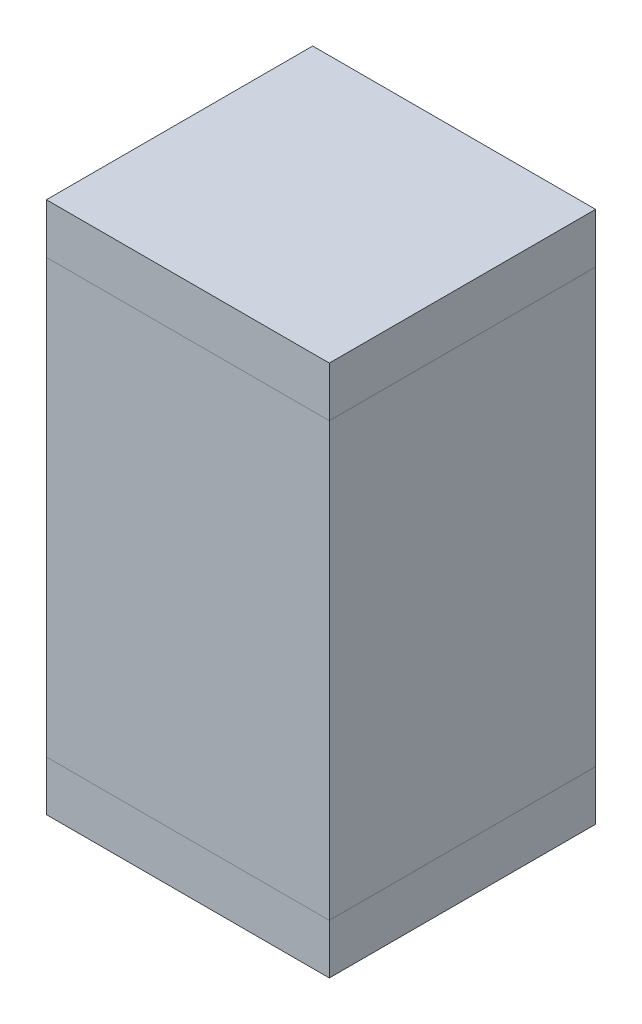
ISO-10303-21;
HEADER;
FILE_DESCRIPTION(('STEP AP214'),'2;1');
FILE_NAME('part.step','',(''),(''),'','','');
FILE_SCHEMA(('AUTOMOTIVE_DESIGN { 1 0 10303 214 1 1 1 1 }'));
ENDSEC;
DATA;
#1=APPLICATION_CONTEXT('core data for automotive mechanical design processes');
#2=APPLICATION_PROTOCOL_DEFINITION('international standard','automotive_design',2000,#1);
#3=PRODUCT_CONTEXT('',#1,'mechanical');
#4=PRODUCT('Part','Part','',(#3));
#5=PRODUCT_RELATED_PRODUCT_CATEGORY('part','',(#4));
#6=PRODUCT_DEFINITION_FORMATION('','',#4);
#7=PRODUCT_DEFINITION_CONTEXT('part definition',#1,'design');
#8=PRODUCT_DEFINITION('design','',#6,#7);
#9=PRODUCT_DEFINITION_SHAPE('','',#8);
#10=(LENGTH_UNIT() NAMED_UNIT(*) SI_UNIT(.MILLI.,.METRE.));
#11=(NAMED_UNIT(*) PLANE_ANGLE_UNIT() SI_UNIT($,.RADIAN.));
#12=(NAMED_UNIT(*) SI_UNIT($,.STERADIAN.) SOLID_ANGLE_UNIT());
#13=UNCERTAINTY_MEASURE_WITH_UNIT(LENGTH_MEASURE(1.E-05),#10,'distance_accuracy_value','');
#14=(GEOMETRIC_REPRESENTATION_CONTEXT(3) GLOBAL_UNCERTAINTY_ASSIGNED_CONTEXT((#13)) GLOBAL_UNIT_ASSIGNED_CONTEXT((#10,
#11,#12)) REPRESENTATION_CONTEXT('',''));
#15=CARTESIAN_POINT('',(0.,0.,0.));
#16=DIRECTION('',(0.,0.,1.));
#17=DIRECTION('',(1.,0.,0.));
#18=AXIS2_PLACEMENT_3D('',#15,#16,#17);
#19=CARTESIAN_POINT('',(0.,0.,0.));
#20=DIRECTION('',(0.,0.,1.));
#21=DIRECTION('',(1.,0.,0.));
#22=AXIS2_PLACEMENT_3D('',#19,#20,#21);
#23=PLANE('',#22);
#24=DIRECTION('',(1.,0.,0.));
#25=VECTOR('',#24,1.);
#26=CARTESIAN_POINT('',(-0.425,0.65,0.));
#27=LINE('',#26,#25);
#28=CARTESIAN_POINT('',(-0.425,0.65,0.));
#29=VERTEX_POINT('',#28);
#30=CARTESIAN_POINT('',(0.425,0.65,0.));
#31=VERTEX_POINT('',#30);
#32=EDGE_CURVE('P0_E27',#29,#31,#27,.T.);
#33=ORIENTED_EDGE('',*,*,#32,.T.);
#34=DIRECTION('',(0.,-1.,0.));
#35=VECTOR('',#34,1.);
#36=CARTESIAN_POINT('',(0.425,0.65,0.));
#37=LINE('',#36,#35);
#38=CARTESIAN_POINT('',(0.425,-0.65,0.));
#39=VERTEX_POINT('',#38);
#40=EDGE_CURVE('P0_E107',#31,#39,#37,.T.);
#41=ORIENTED_EDGE('',*,*,#40,.T.);
#42=DIRECTION('',(-1.,0.,0.));
#43=VECTOR('',#42,1.);
#44=CARTESIAN_POINT('',(0.425,-0.65,0.));
#45=LINE('',#44,#43);
#46=CARTESIAN_POINT('',(-0.425,-0.65,0.));
#47=VERTEX_POINT('',#46);
#48=EDGE_CURVE('P0_E80',#39,#47,#45,.T.);
#49=ORIENTED_EDGE('',*,*,#48,.T.);
#50=DIRECTION('',(0.,1.,0.));
#51=VECTOR('',#50,1.);
#52=CARTESIAN_POINT('',(-0.425,-0.65,0.));
#53=LINE('',#52,#51);
#54=EDGE_CURVE('P0_E57',#47,#29,#53,.T.);
#55=ORIENTED_EDGE('',*,*,#54,.T.);
#56=EDGE_LOOP('',(#33,#41,#49,#55));
#57=FACE_BOUND('',#56,.T.);
#58=ADVANCED_FACE('P0_F17',(#57),#23,.F.);
#59=CARTESIAN_POINT('',(0.,0.,0.8));
#60=DIRECTION('',(0.,0.,1.));
#61=DIRECTION('',(1.,0.,0.));
#62=AXIS2_PLACEMENT_3D('',#59,#60,#61);
#63=PLANE('',#62);
#64=DIRECTION('',(-1.,0.,0.));
#65=VECTOR('',#64,1.);
#66=CARTESIAN_POINT('',(-0.425,0.65,0.8));
#67=LINE('',#66,#65);
#68=CARTESIAN_POINT('',(0.425,0.65,0.8));
#69=VERTEX_POINT('',#68);
#70=CARTESIAN_POINT('',(-0.425,0.65,0.8));
#71=VERTEX_POINT('',#70);
#72=EDGE_CURVE('P0_E11',#69,#71,#67,.T.);
#73=ORIENTED_EDGE('',*,*,#72,.T.);
#74=DIRECTION('',(0.,-1.,0.));
#75=VECTOR('',#74,1.);
#76=CARTESIAN_POINT('',(-0.425,-0.65,0.8));
#77=LINE('',#76,#75);
#78=CARTESIAN_POINT('',(-0.425,-0.65,0.8));
#79=VERTEX_POINT('',#78);
#80=EDGE_CURVE('P0_E62',#71,#79,#77,.T.);
#81=ORIENTED_EDGE('',*,*,#80,.T.);
#82=DIRECTION('',(1.,0.,0.));
#83=VECTOR('',#82,1.);
#84=CARTESIAN_POINT('',(0.425,-0.65,0.8));
#85=LINE('',#84,#83);
#86=CARTESIAN_POINT('',(0.425,-0.65,0.8));
#87=VERTEX_POINT('',#86);
#88=EDGE_CURVE('P0_E64',#79,#87,#85,.T.);
#89=ORIENTED_EDGE('',*,*,#88,.T.);
#90=DIRECTION('',(0.,1.,0.));
#91=VECTOR('',#90,1.);
#92=CARTESIAN_POINT('',(0.425,0.65,0.8));
#93=LINE('',#92,#91);
#94=EDGE_CURVE('P0_E100',#87,#69,#93,.T.);
#95=ORIENTED_EDGE('',*,*,#94,.T.);
#96=EDGE_LOOP('',(#73,#81,#89,#95));
#97=FACE_BOUND('',#96,.T.);
#98=ADVANCED_FACE('P0_F19',(#97),#63,.T.);
#99=CARTESIAN_POINT('',(0.425,0.65,0.));
#100=DIRECTION('',(0.,1.,0.));
#101=DIRECTION('',(1.,0.,0.));
#102=AXIS2_PLACEMENT_3D('',#99,#100,#101);
#103=PLANE('',#102);
#104=ORIENTED_EDGE('',*,*,#32,.F.);
#105=DIRECTION('',(0.,0.,1.));
#106=VECTOR('',#105,1.);
#107=CARTESIAN_POINT('',(-0.425,0.65,0.));
#108=LINE('',#107,#106);
#109=EDGE_CURVE('P0_E67',#29,#71,#108,.T.);
#110=ORIENTED_EDGE('',*,*,#109,.T.);
#111=ORIENTED_EDGE('',*,*,#72,.F.);
#112=DIRECTION('',(0.,0.,1.));
#113=VECTOR('',#112,1.);
#114=CARTESIAN_POINT('',(0.425,0.65,0.));
#115=LINE('',#114,#113);
#116=EDGE_CURVE('P0_E103',#31,#69,#115,.T.);
#117=ORIENTED_EDGE('',*,*,#116,.F.);
#118=EDGE_LOOP('',(#104,#110,#111,#117));
#119=FACE_BOUND('',#118,.T.);
#120=ADVANCED_FACE('P0_F130',(#119),#103,.T.);
#121=CARTESIAN_POINT('',(-0.425,0.65,0.));
#122=DIRECTION('',(-1.,0.,0.));
#123=DIRECTION('',(0.,0.,1.));
#124=AXIS2_PLACEMENT_3D('',#121,#122,#123);
#125=PLANE('',#124);
#126=ORIENTED_EDGE('',*,*,#54,.F.);
#127=DIRECTION('',(0.,0.,1.));
#128=VECTOR('',#127,1.);
#129=CARTESIAN_POINT('',(-0.425,-0.65,0.));
#130=LINE('',#129,#128);
#131=EDGE_CURVE('P0_E69',#47,#79,#130,.T.);
#132=ORIENTED_EDGE('',*,*,#131,.T.);
#133=ORIENTED_EDGE('',*,*,#80,.F.);
#134=ORIENTED_EDGE('',*,*,#109,.F.);
#135=EDGE_LOOP('',(#126,#132,#133,#134));
#136=FACE_BOUND('',#135,.T.);
#137=ADVANCED_FACE('P0_F70',(#136),#125,.T.);
#138=CARTESIAN_POINT('',(-0.425,-0.65,0.));
#139=DIRECTION('',(0.,-1.,0.));
#140=DIRECTION('',(0.,0.,-1.));
#141=AXIS2_PLACEMENT_3D('',#138,#139,#140);
#142=PLANE('',#141);
#143=ORIENTED_EDGE('',*,*,#48,.F.);
#144=DIRECTION('',(0.,0.,1.));
#145=VECTOR('',#144,1.);
#146=CARTESIAN_POINT('',(0.425,-0.65,0.));
#147=LINE('',#146,#145);
#148=EDGE_CURVE('P0_E77',#39,#87,#147,.T.);
#149=ORIENTED_EDGE('',*,*,#148,.T.);
#150=ORIENTED_EDGE('',*,*,#88,.F.);
#151=ORIENTED_EDGE('',*,*,#131,.F.);
#152=EDGE_LOOP('',(#143,#149,#150,#151));
#153=FACE_BOUND('',#152,.T.);
#154=ADVANCED_FACE('P0_F75',(#153),#142,.T.);
#155=CARTESIAN_POINT('',(0.425,-0.65,0.));
#156=DIRECTION('',(1.,0.,0.));
#157=DIRECTION('',(0.,1.,0.));
#158=AXIS2_PLACEMENT_3D('',#155,#156,#157);
#159=PLANE('',#158);
#160=ORIENTED_EDGE('',*,*,#40,.F.);
#161=ORIENTED_EDGE('',*,*,#116,.T.);
#162=ORIENTED_EDGE('',*,*,#94,.F.);
#163=ORIENTED_EDGE('',*,*,#148,.F.);
#164=EDGE_LOOP('',(#160,#161,#162,#163));
#165=FACE_BOUND('',#164,.T.);
#166=ADVANCED_FACE('P0_F117',(#165),#159,.T.);
#167=CLOSED_SHELL('',(#58,#98,#120,#137,#154,#166));
#168=MANIFOLD_SOLID_BREP('P0_B1',#167);
#169=CARTESIAN_POINT('',(0.425,0.65,0.));
#170=DIRECTION('',(0.,1.,0.));
#171=DIRECTION('',(1.,0.,0.));
#172=AXIS2_PLACEMENT_3D('',#169,#170,#171);
#173=PLANE('',#172);
#174=DIRECTION('',(1.,0.,0.));
#175=VECTOR('',#174,1.);
#176=CARTESIAN_POINT('',(-0.425,0.65,0.));
#177=LINE('',#176,#175);
#178=CARTESIAN_POINT('',(-0.425,0.65,0.));
#179=VERTEX_POINT('',#178);
#180=CARTESIAN_POINT('',(0.425,0.65,0.));
#181=VERTEX_POINT('',#180);
#182=EDGE_CURVE('P1_E27',#179,#181,#177,.T.);
#183=ORIENTED_EDGE('',*,*,#182,.T.);
#184=DIRECTION('',(0.,0.,1.));
#185=VECTOR('',#184,1.);
#186=CARTESIAN_POINT('',(0.425,0.65,0.));
#187=LINE('',#186,#185);
#188=CARTESIAN_POINT('',(0.425,0.65,0.8));
#189=VERTEX_POINT('',#188);
#190=EDGE_CURVE('P1_E92',#181,#189,#187,.T.);
#191=ORIENTED_EDGE('',*,*,#190,.T.);
#192=DIRECTION('',(-1.,0.,0.));
#193=VECTOR('',#192,1.);
#194=CARTESIAN_POINT('',(-0.425,0.65,0.8));
#195=LINE('',#194,#193);
#196=CARTESIAN_POINT('',(-0.425,0.65,0.8));
#197=VERTEX_POINT('',#196);
#198=EDGE_CURVE('P1_E86',#189,#197,#195,.T.);
#199=ORIENTED_EDGE('',*,*,#198,.T.);
#200=DIRECTION('',(0.,0.,1.));
#201=VECTOR('',#200,1.);
#202=CARTESIAN_POINT('',(-0.425,0.65,0.));
#203=LINE('',#202,#201);
#204=EDGE_CURVE('P1_E72',#179,#197,#203,.T.);
#205=ORIENTED_EDGE('',*,*,#204,.F.);
#206=EDGE_LOOP('',(#183,#191,#199,#205));
#207=FACE_BOUND('',#206,.T.);
#208=ADVANCED_FACE('P1_F17',(#207),#173,.F.);
#209=CARTESIAN_POINT('',(0.425,0.8,0.));
#210=DIRECTION('',(0.,1.,0.));
#211=DIRECTION('',(1.,0.,0.));
#212=AXIS2_PLACEMENT_3D('',#209,#210,#211);
#213=PLANE('',#212);
#214=DIRECTION('',(-1.,0.,0.));
#215=VECTOR('',#214,1.);
#216=CARTESIAN_POINT('',(-0.425,0.8,0.));
#217=LINE('',#216,#215);
#218=CARTESIAN_POINT('',(0.425,0.8,0.));
#219=VERTEX_POINT('',#218);
#220=CARTESIAN_POINT('',(-0.425,0.8,0.));
#221=VERTEX_POINT('',#220);
#222=EDGE_CURVE('P1_E11',#219,#221,#217,.T.);
#223=ORIENTED_EDGE('',*,*,#222,.T.);
#224=DIRECTION('',(0.,0.,1.));
#225=VECTOR('',#224,1.);
#226=CARTESIAN_POINT('',(-0.425,0.8,0.));
#227=LINE('',#226,#225);
#228=CARTESIAN_POINT('',(-0.425,0.8,0.8));
#229=VERTEX_POINT('',#228);
#230=EDGE_CURVE('P1_E21',#221,#229,#227,.T.);
#231=ORIENTED_EDGE('',*,*,#230,.T.);
#232=DIRECTION('',(1.,0.,0.));
#233=VECTOR('',#232,1.);
#234=CARTESIAN_POINT('',(-0.425,0.8,0.8));
#235=LINE('',#234,#233);
#236=CARTESIAN_POINT('',(0.425,0.8,0.8));
#237=VERTEX_POINT('',#236);
#238=EDGE_CURVE('P1_E88',#229,#237,#235,.T.);
#239=ORIENTED_EDGE('',*,*,#238,.T.);
#240=DIRECTION('',(0.,0.,-1.));
#241=VECTOR('',#240,1.);
#242=CARTESIAN_POINT('',(0.425,0.8,0.));
#243=LINE('',#242,#241);
#244=EDGE_CURVE('P1_E100',#237,#219,#243,.T.);
#245=ORIENTED_EDGE('',*,*,#244,.T.);
#246=EDGE_LOOP('',(#223,#231,#239,#245));
#247=FACE_BOUND('',#246,.T.);
#248=ADVANCED_FACE('P1_F19',(#247),#213,.T.);
#249=CARTESIAN_POINT('',(0.425,0.65,0.));
#250=DIRECTION('',(0.,0.,-1.));
#251=DIRECTION('',(0.,-1.,0.));
#252=AXIS2_PLACEMENT_3D('',#249,#250,#251);
#253=PLANE('',#252);
#254=ORIENTED_EDGE('',*,*,#182,.F.);
#255=DIRECTION('',(0.,1.,0.));
#256=VECTOR('',#255,1.);
#257=CARTESIAN_POINT('',(-0.425,0.65,0.));
#258=LINE('',#257,#256);
#259=EDGE_CURVE('P1_E78',#179,#221,#258,.T.);
#260=ORIENTED_EDGE('',*,*,#259,.T.);
#261=ORIENTED_EDGE('',*,*,#222,.F.);
#262=DIRECTION('',(0.,1.,0.));
#263=VECTOR('',#262,1.);
#264=CARTESIAN_POINT('',(0.425,0.65,0.));
#265=LINE('',#264,#263);
#266=EDGE_CURVE('P1_E113',#181,#219,#265,.T.);
#267=ORIENTED_EDGE('',*,*,#266,.F.);
#268=EDGE_LOOP('',(#254,#260,#261,#267));
#269=FACE_BOUND('',#268,.T.);
#270=ADVANCED_FACE('P1_F125',(#269),#253,.T.);
#271=CARTESIAN_POINT('',(-0.425,0.65,0.));
#272=DIRECTION('',(-1.,0.,0.));
#273=DIRECTION('',(0.,0.,1.));
#274=AXIS2_PLACEMENT_3D('',#271,#272,#273);
#275=PLANE('',#274);
#276=ORIENTED_EDGE('',*,*,#204,.T.);
#277=DIRECTION('',(0.,1.,0.));
#278=VECTOR('',#277,1.);
#279=CARTESIAN_POINT('',(-0.425,0.65,0.8));
#280=LINE('',#279,#278);
#281=EDGE_CURVE('P1_E76',#197,#229,#280,.T.);
#282=ORIENTED_EDGE('',*,*,#281,.T.);
#283=ORIENTED_EDGE('',*,*,#230,.F.);
#284=ORIENTED_EDGE('',*,*,#259,.F.);
#285=EDGE_LOOP('',(#276,#282,#283,#284));
#286=FACE_BOUND('',#285,.T.);
#287=ADVANCED_FACE('P1_F74',(#286),#275,.T.);
#288=CARTESIAN_POINT('',(-0.425,0.65,0.8));
#289=DIRECTION('',(0.,0.,1.));
#290=DIRECTION('',(1.,0.,0.));
#291=AXIS2_PLACEMENT_3D('',#288,#289,#290);
#292=PLANE('',#291);
#293=ORIENTED_EDGE('',*,*,#198,.F.);
#294=DIRECTION('',(0.,1.,0.));
#295=VECTOR('',#294,1.);
#296=CARTESIAN_POINT('',(0.425,0.65,0.8));
#297=LINE('',#296,#295);
#298=EDGE_CURVE('P1_E94',#189,#237,#297,.T.);
#299=ORIENTED_EDGE('',*,*,#298,.T.);
#300=ORIENTED_EDGE('',*,*,#238,.F.);
#301=ORIENTED_EDGE('',*,*,#281,.F.);
#302=EDGE_LOOP('',(#293,#299,#300,#301));
#303=FACE_BOUND('',#302,.T.);
#304=ADVANCED_FACE('P1_F84',(#303),#292,.T.);
#305=CARTESIAN_POINT('',(0.425,0.65,0.8));
#306=DIRECTION('',(1.,0.,0.));
#307=DIRECTION('',(0.,1.,0.));
#308=AXIS2_PLACEMENT_3D('',#305,#306,#307);
#309=PLANE('',#308);
#310=ORIENTED_EDGE('',*,*,#190,.F.);
#311=ORIENTED_EDGE('',*,*,#266,.T.);
#312=ORIENTED_EDGE('',*,*,#244,.F.);
#313=ORIENTED_EDGE('',*,*,#298,.F.);
#314=EDGE_LOOP('',(#310,#311,#312,#313));
#315=FACE_BOUND('',#314,.T.);
#316=ADVANCED_FACE('P1_F124',(#315),#309,.T.);
#317=CLOSED_SHELL('',(#208,#248,#270,#287,#304,#316));
#318=MANIFOLD_SOLID_BREP('P1_B1',#317);
#319=CARTESIAN_POINT('',(-0.425,-0.65,0.));
#320=DIRECTION('',(0.,-1.,0.));
#321=DIRECTION('',(0.,0.,-1.));
#322=AXIS2_PLACEMENT_3D('',#319,#320,#321);
#323=PLANE('',#322);
#324=DIRECTION('',(-1.,0.,0.));
#325=VECTOR('',#324,1.);
#326=CARTESIAN_POINT('',(0.425,-0.65,0.));
#327=LINE('',#326,#325);
#328=CARTESIAN_POINT('',(0.425,-0.65,0.));
#329=VERTEX_POINT('',#328);
#330=CARTESIAN_POINT('',(-0.425,-0.65,0.));
#331=VERTEX_POINT('',#330);
#332=EDGE_CURVE('P2_E25',#329,#331,#327,.T.);
#333=ORIENTED_EDGE('',*,*,#332,.T.);
#334=DIRECTION('',(0.,0.,1.));
#335=VECTOR('',#334,1.);
#336=CARTESIAN_POINT('',(-0.425,-0.65,0.));
#337=LINE('',#336,#335);
#338=CARTESIAN_POINT('',(-0.425,-0.65,0.8));
#339=VERTEX_POINT('',#338);
#340=EDGE_CURVE('P2_E71',#331,#339,#337,.T.);
#341=ORIENTED_EDGE('',*,*,#340,.T.);
#342=DIRECTION('',(1.,0.,0.));
#343=VECTOR('',#342,1.);
#344=CARTESIAN_POINT('',(0.425,-0.65,0.8));
#345=LINE('',#344,#343);
#346=CARTESIAN_POINT('',(0.425,-0.65,0.8));
#347=VERTEX_POINT('',#346);
#348=EDGE_CURVE('P2_E92',#339,#347,#345,.T.);
#349=ORIENTED_EDGE('',*,*,#348,.T.);
#350=DIRECTION('',(0.,0.,1.));
#351=VECTOR('',#350,1.);
#352=CARTESIAN_POINT('',(0.425,-0.65,0.));
#353=LINE('',#352,#351);
#354=EDGE_CURVE('P2_E72',#329,#347,#353,.T.);
#355=ORIENTED_EDGE('',*,*,#354,.F.);
#356=EDGE_LOOP('',(#333,#341,#349,#355));
#357=FACE_BOUND('',#356,.T.);
#358=ADVANCED_FACE('P2_F17',(#357),#323,.F.);
#359=CARTESIAN_POINT('',(-0.425,-0.8,0.));
#360=DIRECTION('',(0.,-1.,0.));
#361=DIRECTION('',(0.,0.,-1.));
#362=AXIS2_PLACEMENT_3D('',#359,#360,#361);
#363=PLANE('',#362);
#364=DIRECTION('',(1.,0.,0.));
#365=VECTOR('',#364,1.);
#366=CARTESIAN_POINT('',(0.425,-0.8,0.));
#367=LINE('',#366,#365);
#368=CARTESIAN_POINT('',(-0.425,-0.8,0.));
#369=VERTEX_POINT('',#368);
#370=CARTESIAN_POINT('',(0.425,-0.8,0.));
#371=VERTEX_POINT('',#370);
#372=EDGE_CURVE('P2_E11',#369,#371,#367,.T.);
#373=ORIENTED_EDGE('',*,*,#372,.T.);
#374=DIRECTION('',(0.,0.,1.));
#375=VECTOR('',#374,1.);
#376=CARTESIAN_POINT('',(0.425,-0.8,0.));
#377=LINE('',#376,#375);
#378=CARTESIAN_POINT('',(0.425,-0.8,0.8));
#379=VERTEX_POINT('',#378);
#380=EDGE_CURVE('P2_E97',#371,#379,#377,.T.);
#381=ORIENTED_EDGE('',*,*,#380,.T.);
#382=DIRECTION('',(-1.,0.,0.));
#383=VECTOR('',#382,1.);
#384=CARTESIAN_POINT('',(0.425,-0.8,0.8));
#385=LINE('',#384,#383);
#386=CARTESIAN_POINT('',(-0.425,-0.8,0.8));
#387=VERTEX_POINT('',#386);
#388=EDGE_CURVE('P2_E93',#379,#387,#385,.T.);
#389=ORIENTED_EDGE('',*,*,#388,.T.);
#390=DIRECTION('',(0.,0.,-1.));
#391=VECTOR('',#390,1.);
#392=CARTESIAN_POINT('',(-0.425,-0.8,0.));
#393=LINE('',#392,#391);
#394=EDGE_CURVE('P2_E81',#387,#369,#393,.T.);
#395=ORIENTED_EDGE('',*,*,#394,.T.);
#396=EDGE_LOOP('',(#373,#381,#389,#395));
#397=FACE_BOUND('',#396,.T.);
#398=ADVANCED_FACE('P2_F117',(#397),#363,.T.);
#399=CARTESIAN_POINT('',(-0.425,-0.65,0.));
#400=DIRECTION('',(0.,0.,-1.));
#401=DIRECTION('',(0.,-1.,0.));
#402=AXIS2_PLACEMENT_3D('',#399,#400,#401);
#403=PLANE('',#402);
#404=ORIENTED_EDGE('',*,*,#332,.F.);
#405=DIRECTION('',(0.,-1.,0.));
#406=VECTOR('',#405,1.);
#407=CARTESIAN_POINT('',(0.425,-0.65,0.));
#408=LINE('',#407,#406);
#409=EDGE_CURVE('P2_E74',#329,#371,#408,.T.);
#410=ORIENTED_EDGE('',*,*,#409,.T.);
#411=ORIENTED_EDGE('',*,*,#372,.F.);
#412=DIRECTION('',(0.,-1.,0.));
#413=VECTOR('',#412,1.);
#414=CARTESIAN_POINT('',(-0.425,-0.65,0.));
#415=LINE('',#414,#413);
#416=EDGE_CURVE('P2_E76',#331,#369,#415,.T.);
#417=ORIENTED_EDGE('',*,*,#416,.F.);
#418=EDGE_LOOP('',(#404,#410,#411,#417));
#419=FACE_BOUND('',#418,.T.);
#420=ADVANCED_FACE('P2_F77',(#419),#403,.T.);
#421=CARTESIAN_POINT('',(0.425,-0.65,0.));
#422=DIRECTION('',(1.,0.,0.));
#423=DIRECTION('',(0.,1.,0.));
#424=AXIS2_PLACEMENT_3D('',#421,#422,#423);
#425=PLANE('',#424);
#426=ORIENTED_EDGE('',*,*,#354,.T.);
#427=DIRECTION('',(0.,-1.,0.));
#428=VECTOR('',#427,1.);
#429=CARTESIAN_POINT('',(0.425,-0.65,0.8));
#430=LINE('',#429,#428);
#431=EDGE_CURVE('P2_E104',#347,#379,#430,.T.);
#432=ORIENTED_EDGE('',*,*,#431,.T.);
#433=ORIENTED_EDGE('',*,*,#380,.F.);
#434=ORIENTED_EDGE('',*,*,#409,.F.);
#435=EDGE_LOOP('',(#426,#432,#433,#434));
#436=FACE_BOUND('',#435,.T.);
#437=ADVANCED_FACE('P2_F114',(#436),#425,.T.);
#438=CARTESIAN_POINT('',(0.425,-0.65,0.8));
#439=DIRECTION('',(0.,0.,1.));
#440=DIRECTION('',(1.,0.,0.));
#441=AXIS2_PLACEMENT_3D('',#438,#439,#440);
#442=PLANE('',#441);
#443=ORIENTED_EDGE('',*,*,#348,.F.);
#444=DIRECTION('',(0.,-1.,0.));
#445=VECTOR('',#444,1.);
#446=CARTESIAN_POINT('',(-0.425,-0.65,0.8));
#447=LINE('',#446,#445);
#448=EDGE_CURVE('P2_E86',#339,#387,#447,.T.);
#449=ORIENTED_EDGE('',*,*,#448,.T.);
#450=ORIENTED_EDGE('',*,*,#388,.F.);
#451=ORIENTED_EDGE('',*,*,#431,.F.);
#452=EDGE_LOOP('',(#443,#449,#450,#451));
#453=FACE_BOUND('',#452,.T.);
#454=ADVANCED_FACE('P2_F119',(#453),#442,.T.);
#455=CARTESIAN_POINT('',(-0.425,-0.65,0.8));
#456=DIRECTION('',(-1.,0.,0.));
#457=DIRECTION('',(0.,0.,1.));
#458=AXIS2_PLACEMENT_3D('',#455,#456,#457);
#459=PLANE('',#458);
#460=ORIENTED_EDGE('',*,*,#340,.F.);
#461=ORIENTED_EDGE('',*,*,#416,.T.);
#462=ORIENTED_EDGE('',*,*,#394,.F.);
#463=ORIENTED_EDGE('',*,*,#448,.F.);
#464=EDGE_LOOP('',(#460,#461,#462,#463));
#465=FACE_BOUND('',#464,.T.);
#466=ADVANCED_FACE('P2_F84',(#465),#459,.T.);
#467=CLOSED_SHELL('',(#358,#398,#420,#437,#454,#466));
#468=MANIFOLD_SOLID_BREP('P2_B1',#467);
#469=ADVANCED_BREP_SHAPE_REPRESENTATION('',(#18,#168,#318,#468),#14);
#470=SHAPE_DEFINITION_REPRESENTATION(#9,#469);
ENDSEC;
END-ISO-10303-21;
